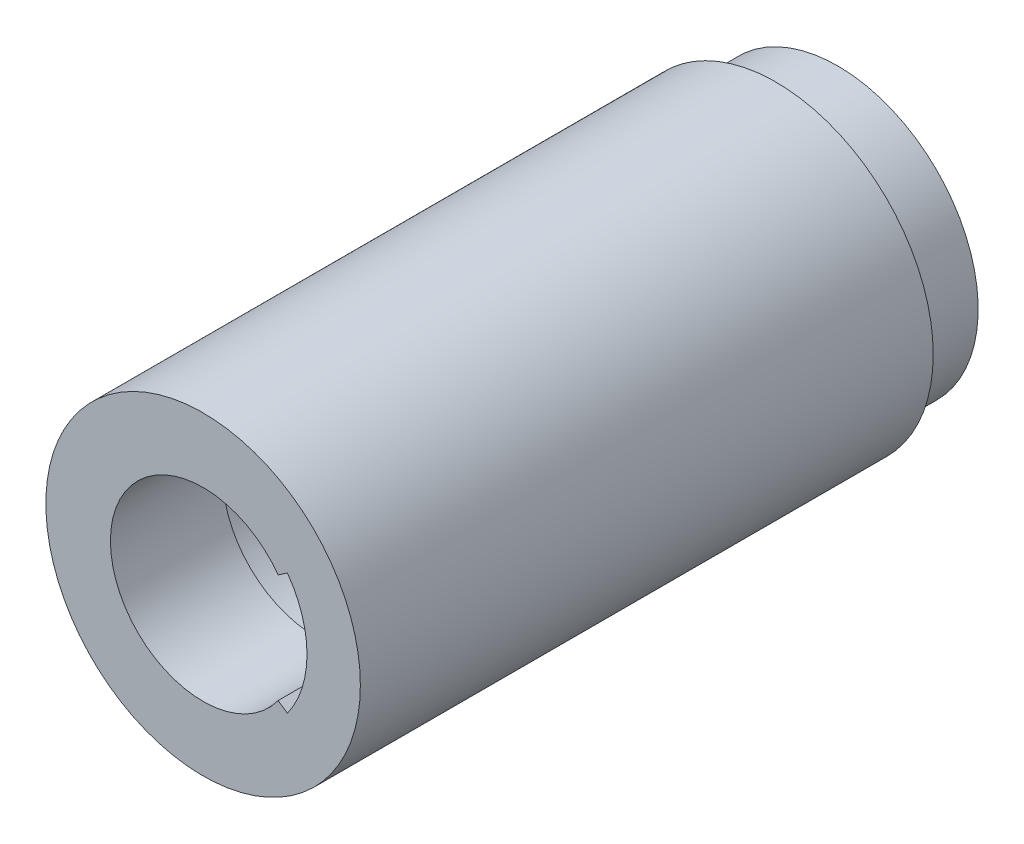
ISO-10303-21;
HEADER;
FILE_DESCRIPTION(('STEP AP214'),'2;1');
FILE_NAME('part.step','',(''),(''),'','','');
FILE_SCHEMA(('AUTOMOTIVE_DESIGN { 1 0 10303 214 1 1 1 1 }'));
ENDSEC;
DATA;
#1=APPLICATION_CONTEXT('core data for automotive mechanical design processes');
#2=APPLICATION_PROTOCOL_DEFINITION('international standard','automotive_design',2000,#1);
#3=PRODUCT_CONTEXT('',#1,'mechanical');
#4=PRODUCT('Part','Part','',(#3));
#5=PRODUCT_RELATED_PRODUCT_CATEGORY('part','',(#4));
#6=PRODUCT_DEFINITION_FORMATION('','',#4);
#7=PRODUCT_DEFINITION_CONTEXT('part definition',#1,'design');
#8=PRODUCT_DEFINITION('design','',#6,#7);
#9=PRODUCT_DEFINITION_SHAPE('','',#8);
#10=(LENGTH_UNIT() NAMED_UNIT(*) SI_UNIT(.MILLI.,.METRE.));
#11=(NAMED_UNIT(*) PLANE_ANGLE_UNIT() SI_UNIT($,.RADIAN.));
#12=(NAMED_UNIT(*) SI_UNIT($,.STERADIAN.) SOLID_ANGLE_UNIT());
#13=UNCERTAINTY_MEASURE_WITH_UNIT(LENGTH_MEASURE(1.E-05),#10,'distance_accuracy_value','');
#14=(GEOMETRIC_REPRESENTATION_CONTEXT(3) GLOBAL_UNCERTAINTY_ASSIGNED_CONTEXT((#13)) GLOBAL_UNIT_ASSIGNED_CONTEXT((#10,
#11,#12)) REPRESENTATION_CONTEXT('',''));
#15=CARTESIAN_POINT('',(0.,0.,0.));
#16=DIRECTION('',(0.,0.,1.));
#17=DIRECTION('',(1.,0.,0.));
#18=AXIS2_PLACEMENT_3D('',#15,#16,#17);
#19=CARTESIAN_POINT('',(150.,-9.30636436000118E-13,33.502));
#20=DIRECTION('',(0.,0.,-1.));
#21=DIRECTION('',(-1.,0.,0.));
#22=AXIS2_PLACEMENT_3D('',#19,#20,#21);
#23=CYLINDRICAL_SURFACE('',#22,10.5);
#24=CARTESIAN_POINT('',(150.,-9.30636436000118E-13,33.5));
#25=DIRECTION('',(0.,0.,1.));
#26=DIRECTION('',(1.,0.,0.));
#27=AXIS2_PLACEMENT_3D('',#24,#25,#26);
#28=CIRCLE('',#27,10.5);
#29=CARTESIAN_POINT('',(160.5,-9.30636436000118E-13,33.5));
#30=VERTEX_POINT('',#29);
#31=EDGE_CURVE('E144',#30,#30,#28,.T.);
#32=ORIENTED_EDGE('',*,*,#31,.T.);
#33=EDGE_LOOP('',(#32));
#34=FACE_BOUND('',#33,.T.);
#35=CARTESIAN_POINT('',(150.,-9.30636436000118E-13,2.5));
#36=DIRECTION('',(0.,0.,1.));
#37=DIRECTION('',(1.,0.,0.));
#38=AXIS2_PLACEMENT_3D('',#35,#36,#37);
#39=CIRCLE('',#38,10.5);
#40=CARTESIAN_POINT('',(160.5,-9.30636436000118E-13,2.5));
#41=VERTEX_POINT('',#40);
#42=EDGE_CURVE('E172',#41,#41,#39,.T.);
#43=ORIENTED_EDGE('',*,*,#42,.F.);
#44=EDGE_LOOP('',(#43));
#45=FACE_BOUND('',#44,.T.);
#46=ADVANCED_FACE('F17',(#34,#45),#23,.F.);
#47=CARTESIAN_POINT('',(150.,-9.3290203257854E-13,2.502));
#48=DIRECTION('',(0.,0.,-1.));
#49=DIRECTION('',(-1.,0.,0.));
#50=AXIS2_PLACEMENT_3D('',#47,#48,#49);
#51=CYLINDRICAL_SURFACE('',#50,12.5);
#52=CARTESIAN_POINT('',(150.,-9.3290203257854E-13,-7.5));
#53=DIRECTION('',(0.,0.,1.));
#54=DIRECTION('',(1.,0.,0.));
#55=AXIS2_PLACEMENT_3D('',#52,#53,#54);
#56=CIRCLE('',#55,12.5);
#57=CARTESIAN_POINT('',(162.5,-9.3290203257854E-13,-7.5));
#58=VERTEX_POINT('',#57);
#59=EDGE_CURVE('E40',#58,#58,#56,.T.);
#60=ORIENTED_EDGE('',*,*,#59,.F.);
#61=EDGE_LOOP('',(#60));
#62=FACE_BOUND('',#61,.T.);
#63=CARTESIAN_POINT('',(150.,-9.3290203257854E-13,-13.));
#64=DIRECTION('',(0.,0.,-1.));
#65=DIRECTION('',(-1.,0.,0.));
#66=AXIS2_PLACEMENT_3D('',#63,#64,#65);
#67=CIRCLE('',#66,12.5);
#68=CARTESIAN_POINT('',(137.5,-9.3290203257854E-13,-13.));
#69=VERTEX_POINT('',#68);
#70=EDGE_CURVE('E161',#69,#69,#67,.T.);
#71=ORIENTED_EDGE('',*,*,#70,.F.);
#72=EDGE_LOOP('',(#71));
#73=FACE_BOUND('',#72,.T.);
#74=ADVANCED_FACE('F273',(#62,#73),#51,.T.);
#75=CARTESIAN_POINT('',(150.,-9.22005527481673E-13,-13.002));
#76=DIRECTION('',(0.,0.,1.));
#77=DIRECTION('',(1.,0.,0.));
#78=AXIS2_PLACEMENT_3D('',#75,#76,#77);
#79=CYLINDRICAL_SURFACE('',#78,9.25);
#80=CARTESIAN_POINT('',(150.,-9.22005527481673E-13,-13.));
#81=DIRECTION('',(0.,0.,-1.));
#82=DIRECTION('',(1.,0.,0.));
#83=AXIS2_PLACEMENT_3D('',#80,#81,#82);
#84=CIRCLE('',#83,9.25);
#85=CARTESIAN_POINT('',(157.507366524907,5.40388266533383,-13.));
#86=VERTEX_POINT('',#85);
#87=CARTESIAN_POINT('',(157.507366524908,-5.4038826653344,-13.));
#88=VERTEX_POINT('',#87);
#89=EDGE_CURVE('E171',#86,#88,#84,.T.);
#90=ORIENTED_EDGE('',*,*,#89,.T.);
#91=DIRECTION('',(0.,0.,1.));
#92=VECTOR('',#91,1.);
#93=CARTESIAN_POINT('',(157.507366524908,-5.40388266533442,-13.002));
#94=LINE('',#93,#92);
#95=CARTESIAN_POINT('',(157.507366524908,-5.40388266533442,2.5));
#96=VERTEX_POINT('',#95);
#97=EDGE_CURVE('E220',#88,#96,#94,.T.);
#98=ORIENTED_EDGE('',*,*,#97,.T.);
#99=CARTESIAN_POINT('',(150.,-9.22005527481673E-13,2.5));
#100=DIRECTION('',(0.,0.,1.));
#101=DIRECTION('',(1.,0.,0.));
#102=AXIS2_PLACEMENT_3D('',#99,#100,#101);
#103=CIRCLE('',#102,9.25);
#104=CARTESIAN_POINT('',(157.507366524907,5.40388266533383,2.5));
#105=VERTEX_POINT('',#104);
#106=EDGE_CURVE('E198',#96,#105,#103,.T.);
#107=ORIENTED_EDGE('',*,*,#106,.T.);
#108=DIRECTION('',(0.,0.,1.));
#109=VECTOR('',#108,1.);
#110=CARTESIAN_POINT('',(157.507366524907,5.40388266533383,-13.002));
#111=LINE('',#110,#109);
#112=EDGE_CURVE('E11',#86,#105,#111,.T.);
#113=ORIENTED_EDGE('',*,*,#112,.F.);
#114=EDGE_LOOP('',(#90,#98,#107,#113));
#115=FACE_BOUND('',#114,.T.);
#116=ADVANCED_FACE('F19',(#115),#79,.F.);
#117=CARTESIAN_POINT('',(156.988952443052,5.05420795187141,-13.002));
#118=DIRECTION('',(0.559192903470744,-0.829037572555044,0.));
#119=DIRECTION('',(0.,0.,-1.));
#120=AXIS2_PLACEMENT_3D('',#117,#118,#119);
#121=PLANE('',#120);
#122=ORIENTED_EDGE('',*,*,#112,.T.);
#123=DIRECTION('',(0.829037572555044,0.559192903470744,0.));
#124=VECTOR('',#123,1.);
#125=CARTESIAN_POINT('',(156.988952443052,5.05420795187141,2.5));
#126=LINE('',#125,#124);
#127=CARTESIAN_POINT('',(156.677896785742,4.84439826180392,2.5));
#128=VERTEX_POINT('',#127);
#129=EDGE_CURVE('E183',#128,#105,#126,.T.);
#130=ORIENTED_EDGE('',*,*,#129,.F.);
#131=DIRECTION('',(0.,0.,1.));
#132=VECTOR('',#131,1.);
#133=CARTESIAN_POINT('',(156.677896785742,4.84439826180392,-13.002));
#134=LINE('',#133,#132);
#135=CARTESIAN_POINT('',(156.677896785742,4.84439826180392,-13.));
#136=VERTEX_POINT('',#135);
#137=EDGE_CURVE('E28',#136,#128,#134,.T.);
#138=ORIENTED_EDGE('',*,*,#137,.F.);
#139=DIRECTION('',(-0.829037572555044,-0.559192903470744,0.));
#140=VECTOR('',#139,1.);
#141=CARTESIAN_POINT('',(156.988952443052,5.05420795187141,-13.));
#142=LINE('',#141,#140);
#143=EDGE_CURVE('E167',#86,#136,#142,.T.);
#144=ORIENTED_EDGE('',*,*,#143,.F.);
#145=EDGE_LOOP('',(#122,#130,#138,#144));
#146=FACE_BOUND('',#145,.T.);
#147=ADVANCED_FACE('F244',(#146),#121,.T.);
#148=CARTESIAN_POINT('',(150.,-9.10926766887341E-13,-13.002));
#149=DIRECTION('',(0.,0.,1.));
#150=DIRECTION('',(1.,0.,0.));
#151=AXIS2_PLACEMENT_3D('',#148,#149,#150);
#152=CYLINDRICAL_SURFACE('',#151,8.25);
#153=CARTESIAN_POINT('',(150.,-9.10926766887341E-13,-13.));
#154=DIRECTION('',(0.,0.,-1.));
#155=DIRECTION('',(1.,0.,0.));
#156=AXIS2_PLACEMENT_3D('',#153,#154,#155);
#157=CIRCLE('',#156,8.25);
#158=CARTESIAN_POINT('',(156.677896785743,-4.84439826180448,-13.));
#159=VERTEX_POINT('',#158);
#160=EDGE_CURVE('E164',#159,#136,#157,.T.);
#161=ORIENTED_EDGE('',*,*,#160,.T.);
#162=ORIENTED_EDGE('',*,*,#137,.T.);
#163=CARTESIAN_POINT('',(150.,-9.10926766887341E-13,2.5));
#164=DIRECTION('',(0.,0.,1.));
#165=DIRECTION('',(1.,0.,0.));
#166=AXIS2_PLACEMENT_3D('',#163,#164,#165);
#167=CIRCLE('',#166,8.25);
#168=CARTESIAN_POINT('',(156.677896785743,-4.84439826180447,2.5));
#169=VERTEX_POINT('',#168);
#170=EDGE_CURVE('E191',#128,#169,#167,.T.);
#171=ORIENTED_EDGE('',*,*,#170,.T.);
#172=DIRECTION('',(0.,0.,1.));
#173=VECTOR('',#172,1.);
#174=CARTESIAN_POINT('',(156.677896785743,-4.84439826180448,-13.002));
#175=LINE('',#174,#173);
#176=EDGE_CURVE('E156',#159,#169,#175,.T.);
#177=ORIENTED_EDGE('',*,*,#176,.F.);
#178=EDGE_LOOP('',(#161,#162,#171,#177));
#179=FACE_BOUND('',#178,.T.);
#180=ADVANCED_FACE('F236',(#179),#152,.F.);
#181=CARTESIAN_POINT('',(156.988952443052,-5.054207951872,-13.002));
#182=DIRECTION('',(-0.559192903470746,-0.829037572555042,0.));
#183=DIRECTION('',(-0.829037572555042,0.559192903470746,0.));
#184=AXIS2_PLACEMENT_3D('',#181,#182,#183);
#185=PLANE('',#184);
#186=DIRECTION('',(-0.829037572555042,0.559192903470746,0.));
#187=VECTOR('',#186,1.);
#188=CARTESIAN_POINT('',(156.988952443052,-5.054207951872,-13.));
#189=LINE('',#188,#187);
#190=EDGE_CURVE('E168',#88,#159,#189,.T.);
#191=ORIENTED_EDGE('',*,*,#190,.T.);
#192=ORIENTED_EDGE('',*,*,#176,.T.);
#193=DIRECTION('',(0.829037572555042,-0.559192903470746,0.));
#194=VECTOR('',#193,1.);
#195=CARTESIAN_POINT('',(156.988952443052,-5.054207951872,2.5));
#196=LINE('',#195,#194);
#197=EDGE_CURVE('E204',#169,#96,#196,.T.);
#198=ORIENTED_EDGE('',*,*,#197,.T.);
#199=ORIENTED_EDGE('',*,*,#97,.F.);
#200=EDGE_LOOP('',(#191,#192,#198,#199));
#201=FACE_BOUND('',#200,.T.);
#202=ADVANCED_FACE('F249',(#201),#185,.F.);
#203=CARTESIAN_POINT('',(150.,-9.29811783123569E-13,-7.5));
#204=DIRECTION('',(0.,0.,1.));
#205=DIRECTION('',(1.,0.,0.));
#206=AXIS2_PLACEMENT_3D('',#203,#204,#205);
#207=PLANE('',#206);
#208=CARTESIAN_POINT('',(150.,-9.3127937556967E-13,-7.5));
#209=DIRECTION('',(0.,0.,1.));
#210=DIRECTION('',(1.,0.,0.));
#211=AXIS2_PLACEMENT_3D('',#208,#209,#210);
#212=CIRCLE('',#211,14.);
#213=CARTESIAN_POINT('',(164.,-9.3127937556967E-13,-7.5));
#214=VERTEX_POINT('',#213);
#215=EDGE_CURVE('E99',#214,#214,#212,.T.);
#216=ORIENTED_EDGE('',*,*,#215,.F.);
#217=EDGE_LOOP('',(#216));
#218=FACE_BOUND('',#217,.T.);
#219=ORIENTED_EDGE('',*,*,#59,.T.);
#220=EDGE_LOOP('',(#219));
#221=FACE_BOUND('',#220,.T.);
#222=ADVANCED_FACE('F303',(#218,#221),#207,.F.);
#223=CARTESIAN_POINT('',(91.3372097167676,-2.26207941267376E-12,-13.));
#224=DIRECTION('',(0.,0.,1.));
#225=DIRECTION('',(1.,0.,0.));
#226=AXIS2_PLACEMENT_3D('',#223,#224,#225);
#227=PLANE('',#226);
#228=ORIENTED_EDGE('',*,*,#70,.T.);
#229=EDGE_LOOP('',(#228));
#230=FACE_BOUND('',#229,.T.);
#231=ORIENTED_EDGE('',*,*,#190,.F.);
#232=ORIENTED_EDGE('',*,*,#89,.F.);
#233=ORIENTED_EDGE('',*,*,#143,.T.);
#234=ORIENTED_EDGE('',*,*,#160,.F.);
#235=EDGE_LOOP('',(#231,#232,#233,#234));
#236=FACE_BOUND('',#235,.T.);
#237=ADVANCED_FACE('F255',(#230,#236),#227,.F.);
#238=CARTESIAN_POINT('',(150.,-9.29811783123569E-13,2.5));
#239=DIRECTION('',(0.,0.,1.));
#240=DIRECTION('',(1.,0.,0.));
#241=AXIS2_PLACEMENT_3D('',#238,#239,#240);
#242=PLANE('',#241);
#243=ORIENTED_EDGE('',*,*,#42,.T.);
#244=EDGE_LOOP('',(#243));
#245=FACE_BOUND('',#244,.T.);
#246=ORIENTED_EDGE('',*,*,#106,.F.);
#247=ORIENTED_EDGE('',*,*,#197,.F.);
#248=ORIENTED_EDGE('',*,*,#170,.F.);
#249=ORIENTED_EDGE('',*,*,#129,.T.);
#250=EDGE_LOOP('',(#246,#247,#248,#249));
#251=FACE_BOUND('',#250,.T.);
#252=ADVANCED_FACE('F248',(#245,#251),#242,.T.);
#253=CARTESIAN_POINT('',(150.,-9.29811783123569E-13,43.5));
#254=DIRECTION('',(0.,0.,1.));
#255=DIRECTION('',(1.,0.,0.));
#256=AXIS2_PLACEMENT_3D('',#253,#254,#255);
#257=PLANE('',#256);
#258=CARTESIAN_POINT('',(150.,-9.3127937556967E-13,43.5));
#259=DIRECTION('',(0.,0.,1.));
#260=DIRECTION('',(1.,0.,0.));
#261=AXIS2_PLACEMENT_3D('',#258,#259,#260);
#262=CIRCLE('',#261,14.);
#263=CARTESIAN_POINT('',(164.,-9.3127937556967E-13,43.5));
#264=VERTEX_POINT('',#263);
#265=EDGE_CURVE('E108',#264,#264,#262,.T.);
#266=ORIENTED_EDGE('',*,*,#265,.T.);
#267=EDGE_LOOP('',(#266));
#268=FACE_BOUND('',#267,.T.);
#269=CARTESIAN_POINT('',(150.,-9.22005527481673E-13,43.5));
#270=DIRECTION('',(0.,0.,1.));
#271=DIRECTION('',(1.,0.,0.));
#272=AXIS2_PLACEMENT_3D('',#269,#270,#271);
#273=CIRCLE('',#272,9.25);
#274=CARTESIAN_POINT('',(157.507366524908,-5.40388266533442,43.5));
#275=VERTEX_POINT('',#274);
#276=CARTESIAN_POINT('',(157.507366524907,5.40388266533383,43.5));
#277=VERTEX_POINT('',#276);
#278=EDGE_CURVE('E134',#275,#277,#273,.T.);
#279=ORIENTED_EDGE('',*,*,#278,.F.);
#280=DIRECTION('',(0.829037572555042,-0.559192903470746,0.));
#281=VECTOR('',#280,1.);
#282=CARTESIAN_POINT('',(156.988952443052,-5.054207951872,43.5));
#283=LINE('',#282,#281);
#284=CARTESIAN_POINT('',(156.677896785743,-4.84439826180447,43.5));
#285=VERTEX_POINT('',#284);
#286=EDGE_CURVE('E117',#285,#275,#283,.T.);
#287=ORIENTED_EDGE('',*,*,#286,.F.);
#288=CARTESIAN_POINT('',(150.,-9.10926766887341E-13,43.5));
#289=DIRECTION('',(0.,0.,1.));
#290=DIRECTION('',(1.,0.,0.));
#291=AXIS2_PLACEMENT_3D('',#288,#289,#290);
#292=CIRCLE('',#291,8.25);
#293=CARTESIAN_POINT('',(156.677896785742,4.84439826180392,43.5));
#294=VERTEX_POINT('',#293);
#295=EDGE_CURVE('E208',#294,#285,#292,.T.);
#296=ORIENTED_EDGE('',*,*,#295,.F.);
#297=DIRECTION('',(0.829037572555044,0.559192903470744,0.));
#298=VECTOR('',#297,1.);
#299=CARTESIAN_POINT('',(156.988952443052,5.05420795187141,43.5));
#300=LINE('',#299,#298);
#301=EDGE_CURVE('E141',#294,#277,#300,.T.);
#302=ORIENTED_EDGE('',*,*,#301,.T.);
#303=EDGE_LOOP('',(#279,#287,#296,#302));
#304=FACE_BOUND('',#303,.T.);
#305=ADVANCED_FACE('F140',(#268,#304),#257,.T.);
#306=CARTESIAN_POINT('',(150.,-9.3127937556967E-13,33.5));
#307=DIRECTION('',(0.,0.,1.));
#308=DIRECTION('',(1.,0.,0.));
#309=AXIS2_PLACEMENT_3D('',#306,#307,#308);
#310=CYLINDRICAL_SURFACE('',#309,14.);
#311=ORIENTED_EDGE('',*,*,#215,.T.);
#312=EDGE_LOOP('',(#311));
#313=FACE_BOUND('',#312,.T.);
#314=ORIENTED_EDGE('',*,*,#265,.F.);
#315=EDGE_LOOP('',(#314));
#316=FACE_BOUND('',#315,.T.);
#317=ADVANCED_FACE('F289',(#313,#316),#310,.T.);
#318=CARTESIAN_POINT('',(156.988952443052,5.05420795187141,33.5));
#319=DIRECTION('',(0.559192903470744,-0.829037572555044,0.));
#320=DIRECTION('',(0.,0.,-1.));
#321=AXIS2_PLACEMENT_3D('',#318,#319,#320);
#322=PLANE('',#321);
#323=ORIENTED_EDGE('',*,*,#301,.F.);
#324=DIRECTION('',(0.,0.,1.));
#325=VECTOR('',#324,1.);
#326=CARTESIAN_POINT('',(156.677896785742,4.84439826180392,33.5));
#327=LINE('',#326,#325);
#328=CARTESIAN_POINT('',(156.677896785742,4.84439826180392,33.5));
#329=VERTEX_POINT('',#328);
#330=EDGE_CURVE('E21',#329,#294,#327,.T.);
#331=ORIENTED_EDGE('',*,*,#330,.F.);
#332=DIRECTION('',(0.829037572555044,0.559192903470744,0.));
#333=VECTOR('',#332,1.);
#334=CARTESIAN_POINT('',(156.988952443052,5.05420795187141,33.5));
#335=LINE('',#334,#333);
#336=CARTESIAN_POINT('',(157.507366524907,5.40388266533383,33.5));
#337=VERTEX_POINT('',#336);
#338=EDGE_CURVE('E157',#329,#337,#335,.T.);
#339=ORIENTED_EDGE('',*,*,#338,.T.);
#340=DIRECTION('',(0.,0.,1.));
#341=VECTOR('',#340,1.);
#342=CARTESIAN_POINT('',(157.507366524907,5.40388266533383,33.5));
#343=LINE('',#342,#341);
#344=EDGE_CURVE('E138',#337,#277,#343,.T.);
#345=ORIENTED_EDGE('',*,*,#344,.T.);
#346=EDGE_LOOP('',(#323,#331,#339,#345));
#347=FACE_BOUND('',#346,.T.);
#348=ADVANCED_FACE('F284',(#347),#322,.T.);
#349=CARTESIAN_POINT('',(150.,-9.10926766887341E-13,33.5));
#350=DIRECTION('',(0.,0.,1.));
#351=DIRECTION('',(1.,0.,0.));
#352=AXIS2_PLACEMENT_3D('',#349,#350,#351);
#353=CYLINDRICAL_SURFACE('',#352,8.25);
#354=ORIENTED_EDGE('',*,*,#295,.T.);
#355=DIRECTION('',(0.,0.,1.));
#356=VECTOR('',#355,1.);
#357=CARTESIAN_POINT('',(156.677896785743,-4.84439826180447,33.5));
#358=LINE('',#357,#356);
#359=CARTESIAN_POINT('',(156.677896785743,-4.84439826180447,33.5));
#360=VERTEX_POINT('',#359);
#361=EDGE_CURVE('E123',#360,#285,#358,.T.);
#362=ORIENTED_EDGE('',*,*,#361,.F.);
#363=CARTESIAN_POINT('',(150.,-9.10926766887341E-13,33.5));
#364=DIRECTION('',(0.,0.,1.));
#365=DIRECTION('',(1.,0.,0.));
#366=AXIS2_PLACEMENT_3D('',#363,#364,#365);
#367=CIRCLE('',#366,8.25);
#368=EDGE_CURVE('E159',#329,#360,#367,.T.);
#369=ORIENTED_EDGE('',*,*,#368,.F.);
#370=ORIENTED_EDGE('',*,*,#330,.T.);
#371=EDGE_LOOP('',(#354,#362,#369,#370));
#372=FACE_BOUND('',#371,.T.);
#373=ADVANCED_FACE('F288',(#372),#353,.F.);
#374=CARTESIAN_POINT('',(156.988952443052,-5.054207951872,33.5));
#375=DIRECTION('',(-0.559192903470746,-0.829037572555042,0.));
#376=DIRECTION('',(-0.829037572555042,0.559192903470746,0.));
#377=AXIS2_PLACEMENT_3D('',#374,#375,#376);
#378=PLANE('',#377);
#379=ORIENTED_EDGE('',*,*,#286,.T.);
#380=DIRECTION('',(0.,0.,1.));
#381=VECTOR('',#380,1.);
#382=CARTESIAN_POINT('',(157.507366524908,-5.40388266533442,33.5));
#383=LINE('',#382,#381);
#384=CARTESIAN_POINT('',(157.507366524908,-5.40388266533442,33.5));
#385=VERTEX_POINT('',#384);
#386=EDGE_CURVE('E121',#385,#275,#383,.T.);
#387=ORIENTED_EDGE('',*,*,#386,.F.);
#388=DIRECTION('',(0.829037572555042,-0.559192903470746,0.));
#389=VECTOR('',#388,1.);
#390=CARTESIAN_POINT('',(156.988952443052,-5.054207951872,33.5));
#391=LINE('',#390,#389);
#392=EDGE_CURVE('E152',#360,#385,#391,.T.);
#393=ORIENTED_EDGE('',*,*,#392,.F.);
#394=ORIENTED_EDGE('',*,*,#361,.T.);
#395=EDGE_LOOP('',(#379,#387,#393,#394));
#396=FACE_BOUND('',#395,.T.);
#397=ADVANCED_FACE('F119',(#396),#378,.F.);
#398=CARTESIAN_POINT('',(150.,-9.22005527481673E-13,33.5));
#399=DIRECTION('',(0.,0.,1.));
#400=DIRECTION('',(1.,0.,0.));
#401=AXIS2_PLACEMENT_3D('',#398,#399,#400);
#402=CYLINDRICAL_SURFACE('',#401,9.25);
#403=ORIENTED_EDGE('',*,*,#278,.T.);
#404=ORIENTED_EDGE('',*,*,#344,.F.);
#405=CARTESIAN_POINT('',(150.,-9.22005527481673E-13,33.5));
#406=DIRECTION('',(0.,0.,1.));
#407=DIRECTION('',(1.,0.,0.));
#408=AXIS2_PLACEMENT_3D('',#405,#406,#407);
#409=CIRCLE('',#408,9.25);
#410=EDGE_CURVE('E136',#385,#337,#409,.T.);
#411=ORIENTED_EDGE('',*,*,#410,.F.);
#412=ORIENTED_EDGE('',*,*,#386,.T.);
#413=EDGE_LOOP('',(#403,#404,#411,#412));
#414=FACE_BOUND('',#413,.T.);
#415=ADVANCED_FACE('F132',(#414),#402,.F.);
#416=CARTESIAN_POINT('',(150.,-9.29811783123569E-13,33.5));
#417=DIRECTION('',(0.,0.,1.));
#418=DIRECTION('',(1.,0.,0.));
#419=AXIS2_PLACEMENT_3D('',#416,#417,#418);
#420=PLANE('',#419);
#421=ORIENTED_EDGE('',*,*,#31,.F.);
#422=EDGE_LOOP('',(#421));
#423=FACE_BOUND('',#422,.T.);
#424=ORIENTED_EDGE('',*,*,#410,.T.);
#425=ORIENTED_EDGE('',*,*,#338,.F.);
#426=ORIENTED_EDGE('',*,*,#368,.T.);
#427=ORIENTED_EDGE('',*,*,#392,.T.);
#428=EDGE_LOOP('',(#424,#425,#426,#427));
#429=FACE_BOUND('',#428,.T.);
#430=ADVANCED_FACE('F341',(#423,#429),#420,.F.);
#431=CLOSED_SHELL('',(#46,#74,#116,#147,#180,#202,#222,#237,#252,#305,#317,#348,#373,#397,#415,#430));
#432=MANIFOLD_SOLID_BREP('B1',#431);
#433=ADVANCED_BREP_SHAPE_REPRESENTATION('',(#18,#432),#14);
#434=SHAPE_DEFINITION_REPRESENTATION(#9,#433);
ENDSEC;
END-ISO-10303-21;
